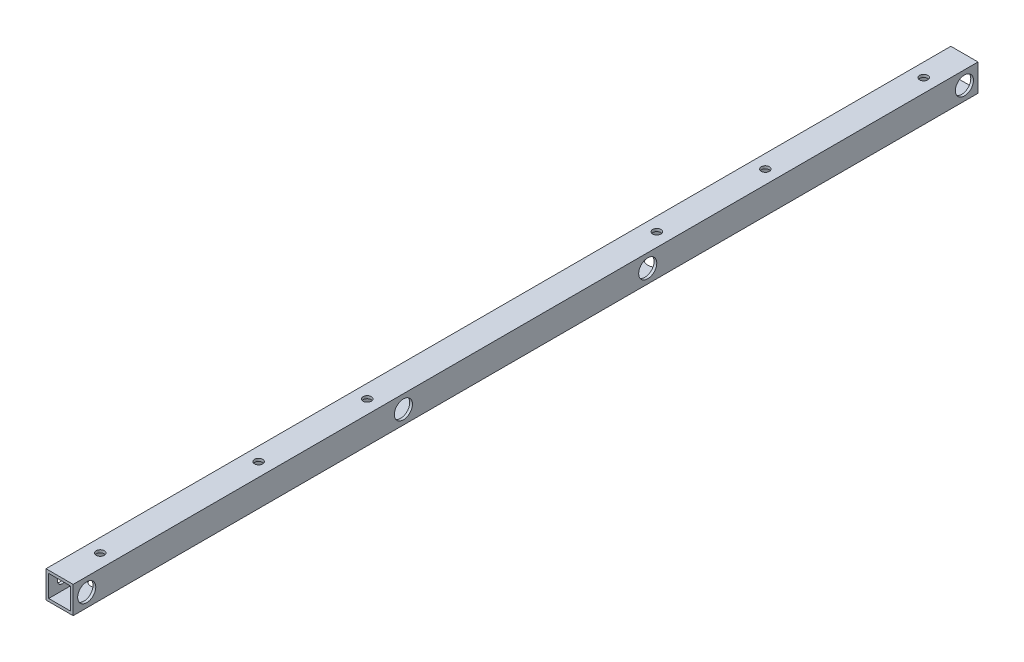
ISO-10303-21;
HEADER;
FILE_DESCRIPTION(('STEP AP214'),'2;1');
FILE_NAME('part.step','',(''),(''),'','','');
FILE_SCHEMA(('AUTOMOTIVE_DESIGN { 1 0 10303 214 1 1 1 1 }'));
ENDSEC;
DATA;
#1=APPLICATION_CONTEXT('core data for automotive mechanical design processes');
#2=APPLICATION_PROTOCOL_DEFINITION('international standard','automotive_design',2000,#1);
#3=PRODUCT_CONTEXT('',#1,'mechanical');
#4=PRODUCT('Part','Part','',(#3));
#5=PRODUCT_RELATED_PRODUCT_CATEGORY('part','',(#4));
#6=PRODUCT_DEFINITION_FORMATION('','',#4);
#7=PRODUCT_DEFINITION_CONTEXT('part definition',#1,'design');
#8=PRODUCT_DEFINITION('design','',#6,#7);
#9=PRODUCT_DEFINITION_SHAPE('','',#8);
#10=(LENGTH_UNIT() NAMED_UNIT(*) SI_UNIT(.MILLI.,.METRE.));
#11=(NAMED_UNIT(*) PLANE_ANGLE_UNIT() SI_UNIT($,.RADIAN.));
#12=(NAMED_UNIT(*) SI_UNIT($,.STERADIAN.) SOLID_ANGLE_UNIT());
#13=UNCERTAINTY_MEASURE_WITH_UNIT(LENGTH_MEASURE(1.E-05),#10,'distance_accuracy_value','');
#14=(GEOMETRIC_REPRESENTATION_CONTEXT(3) GLOBAL_UNCERTAINTY_ASSIGNED_CONTEXT((#13)) GLOBAL_UNIT_ASSIGNED_CONTEXT((#10,
#11,#12)) REPRESENTATION_CONTEXT('',''));
#15=CARTESIAN_POINT('',(0.,0.,0.));
#16=DIRECTION('',(0.,0.,1.));
#17=DIRECTION('',(1.,0.,0.));
#18=AXIS2_PLACEMENT_3D('',#15,#16,#17);
#19=CARTESIAN_POINT('',(0.,0.,500.));
#20=DIRECTION('',(0.,0.,-1.));
#21=DIRECTION('',(-1.,0.,0.));
#22=AXIS2_PLACEMENT_3D('',#19,#20,#21);
#23=PLANE('',#22);
#24=DIRECTION('',(0.,1.,0.));
#25=VECTOR('',#24,1.);
#26=CARTESIAN_POINT('',(7.5,-7.5,500.));
#27=LINE('',#26,#25);
#28=CARTESIAN_POINT('',(7.5,-7.5,500.));
#29=VERTEX_POINT('',#28);
#30=CARTESIAN_POINT('',(7.5,7.5,500.));
#31=VERTEX_POINT('',#30);
#32=EDGE_CURVE('E159',#29,#31,#27,.T.);
#33=ORIENTED_EDGE('',*,*,#32,.T.);
#34=DIRECTION('',(-1.,0.,0.));
#35=VECTOR('',#34,1.);
#36=CARTESIAN_POINT('',(-7.5,7.5,500.));
#37=LINE('',#36,#35);
#38=CARTESIAN_POINT('',(-7.5,7.5,500.));
#39=VERTEX_POINT('',#38);
#40=EDGE_CURVE('E163',#31,#39,#37,.T.);
#41=ORIENTED_EDGE('',*,*,#40,.T.);
#42=DIRECTION('',(0.,-1.,0.));
#43=VECTOR('',#42,1.);
#44=CARTESIAN_POINT('',(-7.5,-7.5,500.));
#45=LINE('',#44,#43);
#46=CARTESIAN_POINT('',(-7.5,-7.5,500.));
#47=VERTEX_POINT('',#46);
#48=EDGE_CURVE('E167',#39,#47,#45,.T.);
#49=ORIENTED_EDGE('',*,*,#48,.T.);
#50=DIRECTION('',(1.,0.,0.));
#51=VECTOR('',#50,1.);
#52=CARTESIAN_POINT('',(-7.5,-7.5,500.));
#53=LINE('',#52,#51);
#54=EDGE_CURVE('E170',#47,#29,#53,.T.);
#55=ORIENTED_EDGE('',*,*,#54,.T.);
#56=EDGE_LOOP('',(#33,#41,#49,#55));
#57=FACE_BOUND('',#56,.T.);
#58=DIRECTION('',(0.,1.,0.));
#59=VECTOR('',#58,1.);
#60=CARTESIAN_POINT('',(6.,-6.,500.));
#61=LINE('',#60,#59);
#62=CARTESIAN_POINT('',(6.,-6.,500.));
#63=VERTEX_POINT('',#62);
#64=CARTESIAN_POINT('',(6.,6.,500.));
#65=VERTEX_POINT('',#64);
#66=EDGE_CURVE('E108',#63,#65,#61,.T.);
#67=ORIENTED_EDGE('',*,*,#66,.F.);
#68=DIRECTION('',(1.,0.,0.));
#69=VECTOR('',#68,1.);
#70=CARTESIAN_POINT('',(-6.,-6.,500.));
#71=LINE('',#70,#69);
#72=CARTESIAN_POINT('',(-6.,-6.,500.));
#73=VERTEX_POINT('',#72);
#74=EDGE_CURVE('E135',#73,#63,#71,.T.);
#75=ORIENTED_EDGE('',*,*,#74,.F.);
#76=DIRECTION('',(0.,-1.,0.));
#77=VECTOR('',#76,1.);
#78=CARTESIAN_POINT('',(-6.,-6.,500.));
#79=LINE('',#78,#77);
#80=CARTESIAN_POINT('',(-6.,6.,500.));
#81=VERTEX_POINT('',#80);
#82=EDGE_CURVE('E130',#81,#73,#79,.T.);
#83=ORIENTED_EDGE('',*,*,#82,.F.);
#84=DIRECTION('',(-1.,0.,0.));
#85=VECTOR('',#84,1.);
#86=CARTESIAN_POINT('',(-6.,6.,500.));
#87=LINE('',#86,#85);
#88=EDGE_CURVE('E117',#65,#81,#87,.T.);
#89=ORIENTED_EDGE('',*,*,#88,.F.);
#90=EDGE_LOOP('',(#67,#75,#83,#89));
#91=FACE_BOUND('',#90,.T.);
#92=ADVANCED_FACE('F40',(#57,#91),#23,.F.);
#93=CARTESIAN_POINT('',(0.,0.,0.));
#94=DIRECTION('',(0.,0.,-1.));
#95=DIRECTION('',(-1.,0.,0.));
#96=AXIS2_PLACEMENT_3D('',#93,#94,#95);
#97=PLANE('',#96);
#98=DIRECTION('',(0.,1.,0.));
#99=VECTOR('',#98,1.);
#100=CARTESIAN_POINT('',(7.5,-7.5,0.));
#101=LINE('',#100,#99);
#102=CARTESIAN_POINT('',(7.5,-7.5,0.));
#103=VERTEX_POINT('',#102);
#104=CARTESIAN_POINT('',(7.5,7.5,0.));
#105=VERTEX_POINT('',#104);
#106=EDGE_CURVE('E126',#103,#105,#101,.T.);
#107=ORIENTED_EDGE('',*,*,#106,.F.);
#108=DIRECTION('',(1.,0.,0.));
#109=VECTOR('',#108,1.);
#110=CARTESIAN_POINT('',(-7.5,-7.5,0.));
#111=LINE('',#110,#109);
#112=CARTESIAN_POINT('',(-7.5,-7.5,0.));
#113=VERTEX_POINT('',#112);
#114=EDGE_CURVE('E164',#113,#103,#111,.T.);
#115=ORIENTED_EDGE('',*,*,#114,.F.);
#116=DIRECTION('',(0.,-1.,0.));
#117=VECTOR('',#116,1.);
#118=CARTESIAN_POINT('',(-7.5,-7.5,0.));
#119=LINE('',#118,#117);
#120=CARTESIAN_POINT('',(-7.5,7.5,0.));
#121=VERTEX_POINT('',#120);
#122=EDGE_CURVE('E180',#121,#113,#119,.T.);
#123=ORIENTED_EDGE('',*,*,#122,.F.);
#124=DIRECTION('',(-1.,0.,0.));
#125=VECTOR('',#124,1.);
#126=CARTESIAN_POINT('',(-7.5,7.5,0.));
#127=LINE('',#126,#125);
#128=EDGE_CURVE('E177',#105,#121,#127,.T.);
#129=ORIENTED_EDGE('',*,*,#128,.F.);
#130=EDGE_LOOP('',(#107,#115,#123,#129));
#131=FACE_BOUND('',#130,.T.);
#132=DIRECTION('',(1.,0.,0.));
#133=VECTOR('',#132,1.);
#134=CARTESIAN_POINT('',(-6.,-6.,0.));
#135=LINE('',#134,#133);
#136=CARTESIAN_POINT('',(-6.,-6.,0.));
#137=VERTEX_POINT('',#136);
#138=CARTESIAN_POINT('',(6.,-6.,0.));
#139=VERTEX_POINT('',#138);
#140=EDGE_CURVE('E118',#137,#139,#135,.T.);
#141=ORIENTED_EDGE('',*,*,#140,.T.);
#142=DIRECTION('',(0.,1.,0.));
#143=VECTOR('',#142,1.);
#144=CARTESIAN_POINT('',(6.,-6.,0.));
#145=LINE('',#144,#143);
#146=CARTESIAN_POINT('',(6.,6.,0.));
#147=VERTEX_POINT('',#146);
#148=EDGE_CURVE('E66',#139,#147,#145,.T.);
#149=ORIENTED_EDGE('',*,*,#148,.T.);
#150=DIRECTION('',(-1.,0.,0.));
#151=VECTOR('',#150,1.);
#152=CARTESIAN_POINT('',(-6.,6.,0.));
#153=LINE('',#152,#151);
#154=CARTESIAN_POINT('',(-6.,6.,0.));
#155=VERTEX_POINT('',#154);
#156=EDGE_CURVE('E124',#147,#155,#153,.T.);
#157=ORIENTED_EDGE('',*,*,#156,.T.);
#158=DIRECTION('',(0.,-1.,0.));
#159=VECTOR('',#158,1.);
#160=CARTESIAN_POINT('',(-6.,-6.,0.));
#161=LINE('',#160,#159);
#162=EDGE_CURVE('E146',#155,#137,#161,.T.);
#163=ORIENTED_EDGE('',*,*,#162,.T.);
#164=EDGE_LOOP('',(#141,#149,#157,#163));
#165=FACE_BOUND('',#164,.T.);
#166=ADVANCED_FACE('F365',(#131,#165),#97,.T.);
#167=CARTESIAN_POINT('',(7.5,-7.5,500.));
#168=DIRECTION('',(-1.,0.,0.));
#169=DIRECTION('',(0.,0.,1.));
#170=AXIS2_PLACEMENT_3D('',#167,#168,#169);
#171=PLANE('',#170);
#172=CARTESIAN_POINT('',(7.5,0.,492.5));
#173=DIRECTION('',(1.,0.,0.));
#174=DIRECTION('',(0.,0.,-1.));
#175=AXIS2_PLACEMENT_3D('',#172,#173,#174);
#176=CIRCLE('',#175,4.99999999999999);
#177=CARTESIAN_POINT('',(7.5,0.,487.5));
#178=VERTEX_POINT('',#177);
#179=EDGE_CURVE('E246',#178,#178,#176,.T.);
#180=ORIENTED_EDGE('',*,*,#179,.F.);
#181=EDGE_LOOP('',(#180));
#182=FACE_BOUND('',#181,.T.);
#183=CARTESIAN_POINT('',(7.5,0.,317.5));
#184=DIRECTION('',(1.,0.,0.));
#185=DIRECTION('',(0.,0.,-1.));
#186=AXIS2_PLACEMENT_3D('',#183,#184,#185);
#187=CIRCLE('',#186,4.99999999999999);
#188=CARTESIAN_POINT('',(7.5,0.,312.5));
#189=VERTEX_POINT('',#188);
#190=EDGE_CURVE('E515',#189,#189,#187,.T.);
#191=ORIENTED_EDGE('',*,*,#190,.F.);
#192=EDGE_LOOP('',(#191));
#193=FACE_BOUND('',#192,.T.);
#194=CARTESIAN_POINT('',(7.5,0.,182.5));
#195=DIRECTION('',(1.,0.,0.));
#196=DIRECTION('',(0.,0.,-1.));
#197=AXIS2_PLACEMENT_3D('',#194,#195,#196);
#198=CIRCLE('',#197,4.99999999999999);
#199=CARTESIAN_POINT('',(7.5,0.,177.5));
#200=VERTEX_POINT('',#199);
#201=EDGE_CURVE('E520',#200,#200,#198,.T.);
#202=ORIENTED_EDGE('',*,*,#201,.F.);
#203=EDGE_LOOP('',(#202));
#204=FACE_BOUND('',#203,.T.);
#205=CARTESIAN_POINT('',(7.5,0.,7.5));
#206=DIRECTION('',(1.,0.,0.));
#207=DIRECTION('',(0.,0.,-1.));
#208=AXIS2_PLACEMENT_3D('',#205,#206,#207);
#209=CIRCLE('',#208,5.);
#210=CARTESIAN_POINT('',(7.5,0.,2.5));
#211=VERTEX_POINT('',#210);
#212=EDGE_CURVE('E525',#211,#211,#209,.T.);
#213=ORIENTED_EDGE('',*,*,#212,.F.);
#214=EDGE_LOOP('',(#213));
#215=FACE_BOUND('',#214,.T.);
#216=ORIENTED_EDGE('',*,*,#106,.T.);
#217=DIRECTION('',(0.,0.,-1.));
#218=VECTOR('',#217,1.);
#219=CARTESIAN_POINT('',(7.5,7.5,500.));
#220=LINE('',#219,#218);
#221=EDGE_CURVE('E11',#31,#105,#220,.T.);
#222=ORIENTED_EDGE('',*,*,#221,.F.);
#223=ORIENTED_EDGE('',*,*,#32,.F.);
#224=DIRECTION('',(0.,0.,-1.));
#225=VECTOR('',#224,1.);
#226=CARTESIAN_POINT('',(7.5,-7.5,500.));
#227=LINE('',#226,#225);
#228=EDGE_CURVE('E173',#29,#103,#227,.T.);
#229=ORIENTED_EDGE('',*,*,#228,.T.);
#230=EDGE_LOOP('',(#216,#222,#223,#229));
#231=FACE_BOUND('',#230,.T.);
#232=ADVANCED_FACE('F42',(#182,#193,#204,#215,#231),#171,.F.);
#233=CARTESIAN_POINT('',(-7.5,7.5,500.));
#234=DIRECTION('',(0.,-1.,0.));
#235=DIRECTION('',(0.,0.,-1.));
#236=AXIS2_PLACEMENT_3D('',#233,#234,#235);
#237=PLANE('',#236);
#238=CARTESIAN_POINT('',(0.,7.5,390.));
#239=DIRECTION('',(0.,-1.,0.));
#240=DIRECTION('',(0.,0.,-1.));
#241=AXIS2_PLACEMENT_3D('',#238,#239,#240);
#242=CIRCLE('',#241,2.25);
#243=CARTESIAN_POINT('',(0.,7.5,387.75));
#244=VERTEX_POINT('',#243);
#245=EDGE_CURVE('E313',#244,#244,#242,.T.);
#246=ORIENTED_EDGE('',*,*,#245,.T.);
#247=EDGE_LOOP('',(#246));
#248=FACE_BOUND('',#247,.T.);
#249=CARTESIAN_POINT('',(2.05814939933146E-13,7.5,330.));
#250=DIRECTION('',(0.,-1.,0.));
#251=DIRECTION('',(0.,0.,-1.));
#252=AXIS2_PLACEMENT_3D('',#249,#250,#251);
#253=CIRCLE('',#252,2.25);
#254=CARTESIAN_POINT('',(2.05814939933146E-13,7.5,327.75));
#255=VERTEX_POINT('',#254);
#256=EDGE_CURVE('E305',#255,#255,#253,.T.);
#257=ORIENTED_EDGE('',*,*,#256,.T.);
#258=EDGE_LOOP('',(#257));
#259=FACE_BOUND('',#258,.T.);
#260=CARTESIAN_POINT('',(7.54654779754869E-13,7.5,170.));
#261=DIRECTION('',(0.,-1.,0.));
#262=DIRECTION('',(0.,0.,-1.));
#263=AXIS2_PLACEMENT_3D('',#260,#261,#262);
#264=CIRCLE('',#263,2.25);
#265=CARTESIAN_POINT('',(7.54654779754869E-13,7.5,167.75));
#266=VERTEX_POINT('',#265);
#267=EDGE_CURVE('E297',#266,#266,#264,.T.);
#268=ORIENTED_EDGE('',*,*,#267,.T.);
#269=EDGE_LOOP('',(#268));
#270=FACE_BOUND('',#269,.T.);
#271=CARTESIAN_POINT('',(9.61961098007528E-13,7.5,110.));
#272=DIRECTION('',(0.,-1.,0.));
#273=DIRECTION('',(0.,0.,-1.));
#274=AXIS2_PLACEMENT_3D('',#271,#272,#273);
#275=CIRCLE('',#274,2.25);
#276=CARTESIAN_POINT('',(9.61961098007528E-13,7.5,107.75));
#277=VERTEX_POINT('',#276);
#278=EDGE_CURVE('E289',#277,#277,#275,.T.);
#279=ORIENTED_EDGE('',*,*,#278,.T.);
#280=EDGE_LOOP('',(#279));
#281=FACE_BOUND('',#280,.T.);
#282=CARTESIAN_POINT('',(0.,7.5,22.5));
#283=DIRECTION('',(0.,1.,0.));
#284=DIRECTION('',(0.,0.,1.));
#285=AXIS2_PLACEMENT_3D('',#282,#283,#284);
#286=CIRCLE('',#285,2.25);
#287=CARTESIAN_POINT('',(0.,7.5,24.75));
#288=VERTEX_POINT('',#287);
#289=EDGE_CURVE('E318',#288,#288,#286,.T.);
#290=ORIENTED_EDGE('',*,*,#289,.F.);
#291=EDGE_LOOP('',(#290));
#292=FACE_BOUND('',#291,.T.);
#293=CARTESIAN_POINT('',(0.,7.5,477.5));
#294=DIRECTION('',(0.,1.,0.));
#295=DIRECTION('',(0.,0.,1.));
#296=AXIS2_PLACEMENT_3D('',#293,#294,#295);
#297=CIRCLE('',#296,2.25);
#298=CARTESIAN_POINT('',(0.,7.5,479.75));
#299=VERTEX_POINT('',#298);
#300=EDGE_CURVE('E317',#299,#299,#297,.T.);
#301=ORIENTED_EDGE('',*,*,#300,.F.);
#302=EDGE_LOOP('',(#301));
#303=FACE_BOUND('',#302,.T.);
#304=ORIENTED_EDGE('',*,*,#128,.T.);
#305=DIRECTION('',(0.,0.,-1.));
#306=VECTOR('',#305,1.);
#307=CARTESIAN_POINT('',(-7.5,7.5,500.));
#308=LINE('',#307,#306);
#309=EDGE_CURVE('E50',#39,#121,#308,.T.);
#310=ORIENTED_EDGE('',*,*,#309,.F.);
#311=ORIENTED_EDGE('',*,*,#40,.F.);
#312=ORIENTED_EDGE('',*,*,#221,.T.);
#313=EDGE_LOOP('',(#304,#310,#311,#312));
#314=FACE_BOUND('',#313,.T.);
#315=ADVANCED_FACE('F381',(#248,#259,#270,#281,#292,#303,#314),#237,.F.);
#316=CARTESIAN_POINT('',(-7.5,-7.5,500.));
#317=DIRECTION('',(1.,0.,0.));
#318=DIRECTION('',(0.,0.,-1.));
#319=AXIS2_PLACEMENT_3D('',#316,#317,#318);
#320=PLANE('',#319);
#321=CARTESIAN_POINT('',(-7.5,0.,492.5));
#322=DIRECTION('',(1.,0.,0.));
#323=DIRECTION('',(0.,0.,-1.));
#324=AXIS2_PLACEMENT_3D('',#321,#322,#323);
#325=CIRCLE('',#324,2.69999999999996);
#326=CARTESIAN_POINT('',(-7.5,0.,489.8));
#327=VERTEX_POINT('',#326);
#328=EDGE_CURVE('E143',#327,#327,#325,.T.);
#329=ORIENTED_EDGE('',*,*,#328,.T.);
#330=EDGE_LOOP('',(#329));
#331=FACE_BOUND('',#330,.T.);
#332=CARTESIAN_POINT('',(-7.5,0.,317.5));
#333=DIRECTION('',(1.,0.,0.));
#334=DIRECTION('',(0.,0.,-1.));
#335=AXIS2_PLACEMENT_3D('',#332,#333,#334);
#336=CIRCLE('',#335,2.69999999999996);
#337=CARTESIAN_POINT('',(-7.5,0.,314.8));
#338=VERTEX_POINT('',#337);
#339=EDGE_CURVE('E210',#338,#338,#336,.T.);
#340=ORIENTED_EDGE('',*,*,#339,.T.);
#341=EDGE_LOOP('',(#340));
#342=FACE_BOUND('',#341,.T.);
#343=CARTESIAN_POINT('',(-7.5,0.,182.5));
#344=DIRECTION('',(1.,0.,0.));
#345=DIRECTION('',(0.,0.,-1.));
#346=AXIS2_PLACEMENT_3D('',#343,#344,#345);
#347=CIRCLE('',#346,2.70000000000001);
#348=CARTESIAN_POINT('',(-7.5,0.,179.8));
#349=VERTEX_POINT('',#348);
#350=EDGE_CURVE('E205',#349,#349,#347,.T.);
#351=ORIENTED_EDGE('',*,*,#350,.T.);
#352=EDGE_LOOP('',(#351));
#353=FACE_BOUND('',#352,.T.);
#354=CARTESIAN_POINT('',(-7.5,0.,7.5));
#355=DIRECTION('',(1.,0.,0.));
#356=DIRECTION('',(0.,0.,-1.));
#357=AXIS2_PLACEMENT_3D('',#354,#355,#356);
#358=CIRCLE('',#357,2.7);
#359=CARTESIAN_POINT('',(-7.5,0.,4.8));
#360=VERTEX_POINT('',#359);
#361=EDGE_CURVE('E199',#360,#360,#358,.T.);
#362=ORIENTED_EDGE('',*,*,#361,.T.);
#363=EDGE_LOOP('',(#362));
#364=FACE_BOUND('',#363,.T.);
#365=ORIENTED_EDGE('',*,*,#122,.T.);
#366=DIRECTION('',(0.,0.,-1.));
#367=VECTOR('',#366,1.);
#368=CARTESIAN_POINT('',(-7.5,-7.5,500.));
#369=LINE('',#368,#367);
#370=EDGE_CURVE('E188',#47,#113,#369,.T.);
#371=ORIENTED_EDGE('',*,*,#370,.F.);
#372=ORIENTED_EDGE('',*,*,#48,.F.);
#373=ORIENTED_EDGE('',*,*,#309,.T.);
#374=EDGE_LOOP('',(#365,#371,#372,#373));
#375=FACE_BOUND('',#374,.T.);
#376=ADVANCED_FACE('F345',(#331,#342,#353,#364,#375),#320,.F.);
#377=CARTESIAN_POINT('',(-7.5,-7.5,500.));
#378=DIRECTION('',(0.,1.,0.));
#379=DIRECTION('',(0.,0.,1.));
#380=AXIS2_PLACEMENT_3D('',#377,#378,#379);
#381=PLANE('',#380);
#382=CARTESIAN_POINT('',(0.,-7.5,22.5));
#383=DIRECTION('',(0.,1.,0.));
#384=DIRECTION('',(0.,0.,1.));
#385=AXIS2_PLACEMENT_3D('',#382,#383,#384);
#386=CIRCLE('',#385,5.);
#387=CARTESIAN_POINT('',(0.,-7.5,27.5));
#388=VERTEX_POINT('',#387);
#389=EDGE_CURVE('E220',#388,#388,#386,.T.);
#390=ORIENTED_EDGE('',*,*,#389,.T.);
#391=EDGE_LOOP('',(#390));
#392=FACE_BOUND('',#391,.T.);
#393=CARTESIAN_POINT('',(7.54654779754869E-13,-7.5,170.));
#394=DIRECTION('',(0.,1.,0.));
#395=DIRECTION('',(0.,0.,1.));
#396=AXIS2_PLACEMENT_3D('',#393,#394,#395);
#397=CIRCLE('',#396,5.);
#398=CARTESIAN_POINT('',(7.54654779754869E-13,-7.5,175.));
#399=VERTEX_POINT('',#398);
#400=EDGE_CURVE('E257',#399,#399,#397,.T.);
#401=ORIENTED_EDGE('',*,*,#400,.T.);
#402=EDGE_LOOP('',(#401));
#403=FACE_BOUND('',#402,.T.);
#404=CARTESIAN_POINT('',(9.61961098007528E-13,-7.5,110.));
#405=DIRECTION('',(0.,1.,0.));
#406=DIRECTION('',(0.,0.,1.));
#407=AXIS2_PLACEMENT_3D('',#404,#405,#406);
#408=CIRCLE('',#407,5.);
#409=CARTESIAN_POINT('',(9.61961098007528E-13,-7.5,115.));
#410=VERTEX_POINT('',#409);
#411=EDGE_CURVE('E263',#410,#410,#408,.T.);
#412=ORIENTED_EDGE('',*,*,#411,.T.);
#413=EDGE_LOOP('',(#412));
#414=FACE_BOUND('',#413,.T.);
#415=CARTESIAN_POINT('',(2.05814939933146E-13,-7.5,330.));
#416=DIRECTION('',(0.,1.,0.));
#417=DIRECTION('',(0.,0.,1.));
#418=AXIS2_PLACEMENT_3D('',#415,#416,#417);
#419=CIRCLE('',#418,5.);
#420=CARTESIAN_POINT('',(2.05814939933146E-13,-7.5,335.));
#421=VERTEX_POINT('',#420);
#422=EDGE_CURVE('E270',#421,#421,#419,.T.);
#423=ORIENTED_EDGE('',*,*,#422,.T.);
#424=EDGE_LOOP('',(#423));
#425=FACE_BOUND('',#424,.T.);
#426=CARTESIAN_POINT('',(0.,-7.5,390.));
#427=DIRECTION('',(0.,1.,0.));
#428=DIRECTION('',(0.,0.,1.));
#429=AXIS2_PLACEMENT_3D('',#426,#427,#428);
#430=CIRCLE('',#429,5.);
#431=CARTESIAN_POINT('',(0.,-7.5,395.));
#432=VERTEX_POINT('',#431);
#433=EDGE_CURVE('E279',#432,#432,#430,.T.);
#434=ORIENTED_EDGE('',*,*,#433,.T.);
#435=EDGE_LOOP('',(#434));
#436=FACE_BOUND('',#435,.T.);
#437=CARTESIAN_POINT('',(0.,-7.5,477.5));
#438=DIRECTION('',(0.,1.,0.));
#439=DIRECTION('',(0.,0.,1.));
#440=AXIS2_PLACEMENT_3D('',#437,#438,#439);
#441=CIRCLE('',#440,5.);
#442=CARTESIAN_POINT('',(0.,-7.5,482.5));
#443=VERTEX_POINT('',#442);
#444=EDGE_CURVE('E275',#443,#443,#441,.T.);
#445=ORIENTED_EDGE('',*,*,#444,.T.);
#446=EDGE_LOOP('',(#445));
#447=FACE_BOUND('',#446,.T.);
#448=ORIENTED_EDGE('',*,*,#114,.T.);
#449=ORIENTED_EDGE('',*,*,#228,.F.);
#450=ORIENTED_EDGE('',*,*,#54,.F.);
#451=ORIENTED_EDGE('',*,*,#370,.T.);
#452=EDGE_LOOP('',(#448,#449,#450,#451));
#453=FACE_BOUND('',#452,.T.);
#454=ADVANCED_FACE('F376',(#392,#403,#414,#425,#436,#447,#453),#381,.F.);
#455=CARTESIAN_POINT('',(6.,-6.,500.));
#456=DIRECTION('',(-1.,0.,0.));
#457=DIRECTION('',(0.,0.,1.));
#458=AXIS2_PLACEMENT_3D('',#455,#456,#457);
#459=PLANE('',#458);
#460=CARTESIAN_POINT('',(6.,0.,492.5));
#461=DIRECTION('',(-1.,0.,0.));
#462=DIRECTION('',(0.,0.,1.));
#463=AXIS2_PLACEMENT_3D('',#460,#461,#462);
#464=CIRCLE('',#463,4.99999999999999);
#465=CARTESIAN_POINT('',(6.,0.,497.5));
#466=VERTEX_POINT('',#465);
#467=EDGE_CURVE('E44',#466,#466,#464,.T.);
#468=ORIENTED_EDGE('',*,*,#467,.F.);
#469=EDGE_LOOP('',(#468));
#470=FACE_BOUND('',#469,.T.);
#471=CARTESIAN_POINT('',(6.,0.,317.5));
#472=DIRECTION('',(-1.,0.,0.));
#473=DIRECTION('',(0.,0.,1.));
#474=AXIS2_PLACEMENT_3D('',#471,#472,#473);
#475=CIRCLE('',#474,4.99999999999999);
#476=CARTESIAN_POINT('',(6.,0.,322.5));
#477=VERTEX_POINT('',#476);
#478=EDGE_CURVE('E249',#477,#477,#475,.T.);
#479=ORIENTED_EDGE('',*,*,#478,.F.);
#480=EDGE_LOOP('',(#479));
#481=FACE_BOUND('',#480,.T.);
#482=CARTESIAN_POINT('',(6.,0.,182.5));
#483=DIRECTION('',(-1.,0.,0.));
#484=DIRECTION('',(0.,0.,1.));
#485=AXIS2_PLACEMENT_3D('',#482,#483,#484);
#486=CIRCLE('',#485,4.99999999999999);
#487=CARTESIAN_POINT('',(6.,0.,187.5));
#488=VERTEX_POINT('',#487);
#489=EDGE_CURVE('E245',#488,#488,#486,.T.);
#490=ORIENTED_EDGE('',*,*,#489,.F.);
#491=EDGE_LOOP('',(#490));
#492=FACE_BOUND('',#491,.T.);
#493=CARTESIAN_POINT('',(6.,0.,7.5));
#494=DIRECTION('',(-1.,0.,0.));
#495=DIRECTION('',(0.,0.,1.));
#496=AXIS2_PLACEMENT_3D('',#493,#494,#495);
#497=CIRCLE('',#496,5.);
#498=CARTESIAN_POINT('',(6.,0.,12.5));
#499=VERTEX_POINT('',#498);
#500=EDGE_CURVE('E241',#499,#499,#497,.T.);
#501=ORIENTED_EDGE('',*,*,#500,.F.);
#502=EDGE_LOOP('',(#501));
#503=FACE_BOUND('',#502,.T.);
#504=ORIENTED_EDGE('',*,*,#148,.F.);
#505=DIRECTION('',(0.,0.,-1.));
#506=VECTOR('',#505,1.);
#507=CARTESIAN_POINT('',(6.,-6.,500.));
#508=LINE('',#507,#506);
#509=EDGE_CURVE('E112',#63,#139,#508,.T.);
#510=ORIENTED_EDGE('',*,*,#509,.F.);
#511=ORIENTED_EDGE('',*,*,#66,.T.);
#512=DIRECTION('',(0.,0.,-1.));
#513=VECTOR('',#512,1.);
#514=CARTESIAN_POINT('',(6.,6.,500.));
#515=LINE('',#514,#513);
#516=EDGE_CURVE('E111',#65,#147,#515,.T.);
#517=ORIENTED_EDGE('',*,*,#516,.T.);
#518=EDGE_LOOP('',(#504,#510,#511,#517));
#519=FACE_BOUND('',#518,.T.);
#520=ADVANCED_FACE('F110',(#470,#481,#492,#503,#519),#459,.T.);
#521=CARTESIAN_POINT('',(-6.,6.,500.));
#522=DIRECTION('',(0.,-1.,0.));
#523=DIRECTION('',(0.,0.,-1.));
#524=AXIS2_PLACEMENT_3D('',#521,#522,#523);
#525=PLANE('',#524);
#526=CARTESIAN_POINT('',(0.,6.,390.));
#527=DIRECTION('',(0.,-1.,0.));
#528=DIRECTION('',(0.,0.,-1.));
#529=AXIS2_PLACEMENT_3D('',#526,#527,#528);
#530=CIRCLE('',#529,2.25);
#531=CARTESIAN_POINT('',(0.,6.,387.75));
#532=VERTEX_POINT('',#531);
#533=EDGE_CURVE('E309',#532,#532,#530,.T.);
#534=ORIENTED_EDGE('',*,*,#533,.F.);
#535=EDGE_LOOP('',(#534));
#536=FACE_BOUND('',#535,.T.);
#537=CARTESIAN_POINT('',(2.05814939933146E-13,6.,330.));
#538=DIRECTION('',(0.,-1.,0.));
#539=DIRECTION('',(0.,0.,-1.));
#540=AXIS2_PLACEMENT_3D('',#537,#538,#539);
#541=CIRCLE('',#540,2.25);
#542=CARTESIAN_POINT('',(2.05814939933146E-13,6.,327.75));
#543=VERTEX_POINT('',#542);
#544=EDGE_CURVE('E301',#543,#543,#541,.T.);
#545=ORIENTED_EDGE('',*,*,#544,.F.);
#546=EDGE_LOOP('',(#545));
#547=FACE_BOUND('',#546,.T.);
#548=CARTESIAN_POINT('',(7.54654779754869E-13,6.,170.));
#549=DIRECTION('',(0.,-1.,0.));
#550=DIRECTION('',(0.,0.,-1.));
#551=AXIS2_PLACEMENT_3D('',#548,#549,#550);
#552=CIRCLE('',#551,2.25);
#553=CARTESIAN_POINT('',(7.54654779754869E-13,6.,167.75));
#554=VERTEX_POINT('',#553);
#555=EDGE_CURVE('E293',#554,#554,#552,.T.);
#556=ORIENTED_EDGE('',*,*,#555,.F.);
#557=EDGE_LOOP('',(#556));
#558=FACE_BOUND('',#557,.T.);
#559=CARTESIAN_POINT('',(9.61961098007528E-13,6.,110.));
#560=DIRECTION('',(0.,-1.,0.));
#561=DIRECTION('',(0.,0.,-1.));
#562=AXIS2_PLACEMENT_3D('',#559,#560,#561);
#563=CIRCLE('',#562,2.25);
#564=CARTESIAN_POINT('',(9.61961098007528E-13,6.,107.75));
#565=VERTEX_POINT('',#564);
#566=EDGE_CURVE('E240',#565,#565,#563,.T.);
#567=ORIENTED_EDGE('',*,*,#566,.F.);
#568=EDGE_LOOP('',(#567));
#569=FACE_BOUND('',#568,.T.);
#570=CARTESIAN_POINT('',(0.,6.,22.5));
#571=DIRECTION('',(0.,-1.,0.));
#572=DIRECTION('',(0.,0.,-1.));
#573=AXIS2_PLACEMENT_3D('',#570,#571,#572);
#574=CIRCLE('',#573,2.25);
#575=CARTESIAN_POINT('',(0.,6.,20.25));
#576=VERTEX_POINT('',#575);
#577=EDGE_CURVE('E200',#576,#576,#574,.T.);
#578=ORIENTED_EDGE('',*,*,#577,.F.);
#579=EDGE_LOOP('',(#578));
#580=FACE_BOUND('',#579,.T.);
#581=CARTESIAN_POINT('',(0.,6.,477.5));
#582=DIRECTION('',(0.,-1.,0.));
#583=DIRECTION('',(0.,0.,-1.));
#584=AXIS2_PLACEMENT_3D('',#581,#582,#583);
#585=CIRCLE('',#584,2.25);
#586=CARTESIAN_POINT('',(0.,6.,475.25));
#587=VERTEX_POINT('',#586);
#588=EDGE_CURVE('E322',#587,#587,#585,.T.);
#589=ORIENTED_EDGE('',*,*,#588,.F.);
#590=EDGE_LOOP('',(#589));
#591=FACE_BOUND('',#590,.T.);
#592=ORIENTED_EDGE('',*,*,#156,.F.);
#593=ORIENTED_EDGE('',*,*,#516,.F.);
#594=ORIENTED_EDGE('',*,*,#88,.T.);
#595=DIRECTION('',(0.,0.,-1.));
#596=VECTOR('',#595,1.);
#597=CARTESIAN_POINT('',(-6.,6.,500.));
#598=LINE('',#597,#596);
#599=EDGE_CURVE('E127',#81,#155,#598,.T.);
#600=ORIENTED_EDGE('',*,*,#599,.T.);
#601=EDGE_LOOP('',(#592,#593,#594,#600));
#602=FACE_BOUND('',#601,.T.);
#603=ADVANCED_FACE('F121',(#536,#547,#558,#569,#580,#591,#602),#525,.T.);
#604=CARTESIAN_POINT('',(-6.,-6.,500.));
#605=DIRECTION('',(1.,0.,0.));
#606=DIRECTION('',(0.,0.,-1.));
#607=AXIS2_PLACEMENT_3D('',#604,#605,#606);
#608=PLANE('',#607);
#609=CARTESIAN_POINT('',(-6.,0.,492.5));
#610=DIRECTION('',(1.,0.,0.));
#611=DIRECTION('',(0.,0.,-1.));
#612=AXIS2_PLACEMENT_3D('',#609,#610,#611);
#613=CIRCLE('',#612,2.69999999999996);
#614=CARTESIAN_POINT('',(-6.,0.,489.8));
#615=VERTEX_POINT('',#614);
#616=EDGE_CURVE('E211',#615,#615,#613,.T.);
#617=ORIENTED_EDGE('',*,*,#616,.F.);
#618=EDGE_LOOP('',(#617));
#619=FACE_BOUND('',#618,.T.);
#620=CARTESIAN_POINT('',(-6.,0.,317.5));
#621=DIRECTION('',(1.,0.,0.));
#622=DIRECTION('',(0.,0.,-1.));
#623=AXIS2_PLACEMENT_3D('',#620,#621,#622);
#624=CIRCLE('',#623,2.69999999999996);
#625=CARTESIAN_POINT('',(-6.,0.,314.8));
#626=VERTEX_POINT('',#625);
#627=EDGE_CURVE('E206',#626,#626,#624,.T.);
#628=ORIENTED_EDGE('',*,*,#627,.F.);
#629=EDGE_LOOP('',(#628));
#630=FACE_BOUND('',#629,.T.);
#631=CARTESIAN_POINT('',(-6.,0.,182.5));
#632=DIRECTION('',(1.,0.,0.));
#633=DIRECTION('',(0.,0.,-1.));
#634=AXIS2_PLACEMENT_3D('',#631,#632,#633);
#635=CIRCLE('',#634,2.70000000000001);
#636=CARTESIAN_POINT('',(-6.,0.,179.8));
#637=VERTEX_POINT('',#636);
#638=EDGE_CURVE('E201',#637,#637,#635,.T.);
#639=ORIENTED_EDGE('',*,*,#638,.F.);
#640=EDGE_LOOP('',(#639));
#641=FACE_BOUND('',#640,.T.);
#642=CARTESIAN_POINT('',(-6.,0.,7.5));
#643=DIRECTION('',(1.,0.,0.));
#644=DIRECTION('',(0.,0.,-1.));
#645=AXIS2_PLACEMENT_3D('',#642,#643,#644);
#646=CIRCLE('',#645,2.7);
#647=CARTESIAN_POINT('',(-6.,0.,4.8));
#648=VERTEX_POINT('',#647);
#649=EDGE_CURVE('E195',#648,#648,#646,.T.);
#650=ORIENTED_EDGE('',*,*,#649,.F.);
#651=EDGE_LOOP('',(#650));
#652=FACE_BOUND('',#651,.T.);
#653=ORIENTED_EDGE('',*,*,#162,.F.);
#654=ORIENTED_EDGE('',*,*,#599,.F.);
#655=ORIENTED_EDGE('',*,*,#82,.T.);
#656=DIRECTION('',(0.,0.,-1.));
#657=VECTOR('',#656,1.);
#658=CARTESIAN_POINT('',(-6.,-6.,500.));
#659=LINE('',#658,#657);
#660=EDGE_CURVE('E58',#73,#137,#659,.T.);
#661=ORIENTED_EDGE('',*,*,#660,.T.);
#662=EDGE_LOOP('',(#653,#654,#655,#661));
#663=FACE_BOUND('',#662,.T.);
#664=ADVANCED_FACE('F420',(#619,#630,#641,#652,#663),#608,.T.);
#665=CARTESIAN_POINT('',(-6.,-6.,500.));
#666=DIRECTION('',(0.,1.,0.));
#667=DIRECTION('',(0.,0.,1.));
#668=AXIS2_PLACEMENT_3D('',#665,#666,#667);
#669=PLANE('',#668);
#670=CARTESIAN_POINT('',(0.,-6.,22.5));
#671=DIRECTION('',(0.,1.,0.));
#672=DIRECTION('',(0.,0.,1.));
#673=AXIS2_PLACEMENT_3D('',#670,#671,#672);
#674=CIRCLE('',#673,5.);
#675=CARTESIAN_POINT('',(0.,-6.,27.5));
#676=VERTEX_POINT('',#675);
#677=EDGE_CURVE('E236',#676,#676,#674,.F.);
#678=ORIENTED_EDGE('',*,*,#677,.T.);
#679=EDGE_LOOP('',(#678));
#680=FACE_BOUND('',#679,.T.);
#681=CARTESIAN_POINT('',(7.54654779754869E-13,-6.,170.));
#682=DIRECTION('',(0.,1.,0.));
#683=DIRECTION('',(0.,0.,1.));
#684=AXIS2_PLACEMENT_3D('',#681,#682,#683);
#685=CIRCLE('',#684,5.);
#686=CARTESIAN_POINT('',(7.54654779754869E-13,-6.,175.));
#687=VERTEX_POINT('',#686);
#688=EDGE_CURVE('E232',#687,#687,#685,.F.);
#689=ORIENTED_EDGE('',*,*,#688,.T.);
#690=EDGE_LOOP('',(#689));
#691=FACE_BOUND('',#690,.T.);
#692=CARTESIAN_POINT('',(9.61961098007528E-13,-6.,110.));
#693=DIRECTION('',(0.,1.,0.));
#694=DIRECTION('',(0.,0.,1.));
#695=AXIS2_PLACEMENT_3D('',#692,#693,#694);
#696=CIRCLE('',#695,5.);
#697=CARTESIAN_POINT('',(9.61961098007528E-13,-6.,115.));
#698=VERTEX_POINT('',#697);
#699=EDGE_CURVE('E228',#698,#698,#696,.F.);
#700=ORIENTED_EDGE('',*,*,#699,.T.);
#701=EDGE_LOOP('',(#700));
#702=FACE_BOUND('',#701,.T.);
#703=CARTESIAN_POINT('',(2.05814939933146E-13,-6.,330.));
#704=DIRECTION('',(0.,1.,0.));
#705=DIRECTION('',(0.,0.,1.));
#706=AXIS2_PLACEMENT_3D('',#703,#704,#705);
#707=CIRCLE('',#706,5.);
#708=CARTESIAN_POINT('',(2.05814939933146E-13,-6.,335.));
#709=VERTEX_POINT('',#708);
#710=EDGE_CURVE('E224',#709,#709,#707,.F.);
#711=ORIENTED_EDGE('',*,*,#710,.T.);
#712=EDGE_LOOP('',(#711));
#713=FACE_BOUND('',#712,.T.);
#714=CARTESIAN_POINT('',(0.,-6.,390.));
#715=DIRECTION('',(0.,1.,0.));
#716=DIRECTION('',(0.,0.,1.));
#717=AXIS2_PLACEMENT_3D('',#714,#715,#716);
#718=CIRCLE('',#717,5.);
#719=CARTESIAN_POINT('',(0.,-6.,395.));
#720=VERTEX_POINT('',#719);
#721=EDGE_CURVE('E219',#720,#720,#718,.F.);
#722=ORIENTED_EDGE('',*,*,#721,.T.);
#723=EDGE_LOOP('',(#722));
#724=FACE_BOUND('',#723,.T.);
#725=CARTESIAN_POINT('',(0.,-6.,477.5));
#726=DIRECTION('',(0.,1.,0.));
#727=DIRECTION('',(0.,0.,1.));
#728=AXIS2_PLACEMENT_3D('',#725,#726,#727);
#729=CIRCLE('',#728,5.);
#730=CARTESIAN_POINT('',(0.,-6.,482.5));
#731=VERTEX_POINT('',#730);
#732=EDGE_CURVE('E215',#731,#731,#729,.F.);
#733=ORIENTED_EDGE('',*,*,#732,.T.);
#734=EDGE_LOOP('',(#733));
#735=FACE_BOUND('',#734,.T.);
#736=ORIENTED_EDGE('',*,*,#140,.F.);
#737=ORIENTED_EDGE('',*,*,#660,.F.);
#738=ORIENTED_EDGE('',*,*,#74,.T.);
#739=ORIENTED_EDGE('',*,*,#509,.T.);
#740=EDGE_LOOP('',(#736,#737,#738,#739));
#741=FACE_BOUND('',#740,.T.);
#742=ADVANCED_FACE('F417',(#680,#691,#702,#713,#724,#735,#741),#669,.T.);
#743=CARTESIAN_POINT('',(-17.5,0.,7.5));
#744=DIRECTION('',(1.,0.,0.));
#745=DIRECTION('',(0.,0.,-1.));
#746=AXIS2_PLACEMENT_3D('',#743,#744,#745);
#747=CYLINDRICAL_SURFACE('',#746,2.7);
#748=ORIENTED_EDGE('',*,*,#649,.T.);
#749=EDGE_LOOP('',(#748));
#750=FACE_BOUND('',#749,.T.);
#751=ORIENTED_EDGE('',*,*,#361,.F.);
#752=EDGE_LOOP('',(#751));
#753=FACE_BOUND('',#752,.T.);
#754=ADVANCED_FACE('F419',(#750,#753),#747,.F.);
#755=CARTESIAN_POINT('',(-17.5,0.,182.5));
#756=DIRECTION('',(1.,0.,0.));
#757=DIRECTION('',(0.,0.,-1.));
#758=AXIS2_PLACEMENT_3D('',#755,#756,#757);
#759=CYLINDRICAL_SURFACE('',#758,2.70000000000001);
#760=ORIENTED_EDGE('',*,*,#638,.T.);
#761=EDGE_LOOP('',(#760));
#762=FACE_BOUND('',#761,.T.);
#763=ORIENTED_EDGE('',*,*,#350,.F.);
#764=EDGE_LOOP('',(#763));
#765=FACE_BOUND('',#764,.T.);
#766=ADVANCED_FACE('F361',(#762,#765),#759,.F.);
#767=CARTESIAN_POINT('',(-17.5,0.,317.5));
#768=DIRECTION('',(1.,0.,0.));
#769=DIRECTION('',(0.,0.,-1.));
#770=AXIS2_PLACEMENT_3D('',#767,#768,#769);
#771=CYLINDRICAL_SURFACE('',#770,2.69999999999996);
#772=ORIENTED_EDGE('',*,*,#627,.T.);
#773=EDGE_LOOP('',(#772));
#774=FACE_BOUND('',#773,.T.);
#775=ORIENTED_EDGE('',*,*,#339,.F.);
#776=EDGE_LOOP('',(#775));
#777=FACE_BOUND('',#776,.T.);
#778=ADVANCED_FACE('F351',(#774,#777),#771,.F.);
#779=CARTESIAN_POINT('',(-17.5,0.,492.5));
#780=DIRECTION('',(1.,0.,0.));
#781=DIRECTION('',(0.,0.,-1.));
#782=AXIS2_PLACEMENT_3D('',#779,#780,#781);
#783=CYLINDRICAL_SURFACE('',#782,2.69999999999996);
#784=ORIENTED_EDGE('',*,*,#616,.T.);
#785=EDGE_LOOP('',(#784));
#786=FACE_BOUND('',#785,.T.);
#787=ORIENTED_EDGE('',*,*,#328,.F.);
#788=EDGE_LOOP('',(#787));
#789=FACE_BOUND('',#788,.T.);
#790=ADVANCED_FACE('F348',(#786,#789),#783,.F.);
#791=CARTESIAN_POINT('',(0.,-17.5,477.5));
#792=DIRECTION('',(0.,1.,0.));
#793=DIRECTION('',(0.,0.,1.));
#794=AXIS2_PLACEMENT_3D('',#791,#792,#793);
#795=CYLINDRICAL_SURFACE('',#794,2.25);
#796=ORIENTED_EDGE('',*,*,#588,.T.);
#797=EDGE_LOOP('',(#796));
#798=FACE_BOUND('',#797,.T.);
#799=ORIENTED_EDGE('',*,*,#300,.T.);
#800=EDGE_LOOP('',(#799));
#801=FACE_BOUND('',#800,.T.);
#802=ADVANCED_FACE('F350',(#798,#801),#795,.F.);
#803=CARTESIAN_POINT('',(0.,-17.5,22.5));
#804=DIRECTION('',(0.,1.,0.));
#805=DIRECTION('',(0.,0.,1.));
#806=AXIS2_PLACEMENT_3D('',#803,#804,#805);
#807=CYLINDRICAL_SURFACE('',#806,2.25);
#808=ORIENTED_EDGE('',*,*,#577,.T.);
#809=EDGE_LOOP('',(#808));
#810=FACE_BOUND('',#809,.T.);
#811=ORIENTED_EDGE('',*,*,#289,.T.);
#812=EDGE_LOOP('',(#811));
#813=FACE_BOUND('',#812,.T.);
#814=ADVANCED_FACE('F358',(#810,#813),#807,.F.);
#815=CARTESIAN_POINT('',(9.61961098007528E-13,12.5,110.));
#816=DIRECTION('',(0.,-1.,0.));
#817=DIRECTION('',(0.,0.,-1.));
#818=AXIS2_PLACEMENT_3D('',#815,#816,#817);
#819=CYLINDRICAL_SURFACE('',#818,2.25);
#820=ORIENTED_EDGE('',*,*,#566,.T.);
#821=EDGE_LOOP('',(#820));
#822=FACE_BOUND('',#821,.T.);
#823=ORIENTED_EDGE('',*,*,#278,.F.);
#824=EDGE_LOOP('',(#823));
#825=FACE_BOUND('',#824,.T.);
#826=ADVANCED_FACE('F454',(#822,#825),#819,.F.);
#827=CARTESIAN_POINT('',(7.54654779754869E-13,12.5,170.));
#828=DIRECTION('',(0.,-1.,0.));
#829=DIRECTION('',(0.,0.,-1.));
#830=AXIS2_PLACEMENT_3D('',#827,#828,#829);
#831=CYLINDRICAL_SURFACE('',#830,2.25);
#832=ORIENTED_EDGE('',*,*,#555,.T.);
#833=EDGE_LOOP('',(#832));
#834=FACE_BOUND('',#833,.T.);
#835=ORIENTED_EDGE('',*,*,#267,.F.);
#836=EDGE_LOOP('',(#835));
#837=FACE_BOUND('',#836,.T.);
#838=ADVANCED_FACE('F458',(#834,#837),#831,.F.);
#839=CARTESIAN_POINT('',(2.05814939933146E-13,12.5,330.));
#840=DIRECTION('',(0.,-1.,0.));
#841=DIRECTION('',(0.,0.,-1.));
#842=AXIS2_PLACEMENT_3D('',#839,#840,#841);
#843=CYLINDRICAL_SURFACE('',#842,2.25);
#844=ORIENTED_EDGE('',*,*,#544,.T.);
#845=EDGE_LOOP('',(#844));
#846=FACE_BOUND('',#845,.T.);
#847=ORIENTED_EDGE('',*,*,#256,.F.);
#848=EDGE_LOOP('',(#847));
#849=FACE_BOUND('',#848,.T.);
#850=ADVANCED_FACE('F464',(#846,#849),#843,.F.);
#851=CARTESIAN_POINT('',(0.,12.5,390.));
#852=DIRECTION('',(0.,-1.,0.));
#853=DIRECTION('',(0.,0.,-1.));
#854=AXIS2_PLACEMENT_3D('',#851,#852,#853);
#855=CYLINDRICAL_SURFACE('',#854,2.25);
#856=ORIENTED_EDGE('',*,*,#533,.T.);
#857=EDGE_LOOP('',(#856));
#858=FACE_BOUND('',#857,.T.);
#859=ORIENTED_EDGE('',*,*,#245,.F.);
#860=EDGE_LOOP('',(#859));
#861=FACE_BOUND('',#860,.T.);
#862=ADVANCED_FACE('F468',(#858,#861),#855,.F.);
#863=CARTESIAN_POINT('',(0.,2.5,477.5));
#864=DIRECTION('',(0.,-1.,0.));
#865=DIRECTION('',(0.,0.,-1.));
#866=AXIS2_PLACEMENT_3D('',#863,#864,#865);
#867=CYLINDRICAL_SURFACE('',#866,5.);
#868=ORIENTED_EDGE('',*,*,#732,.F.);
#869=EDGE_LOOP('',(#868));
#870=FACE_BOUND('',#869,.T.);
#871=ORIENTED_EDGE('',*,*,#444,.F.);
#872=EDGE_LOOP('',(#871));
#873=FACE_BOUND('',#872,.T.);
#874=ADVANCED_FACE('F472',(#870,#873),#867,.F.);
#875=CARTESIAN_POINT('',(0.,2.5,390.));
#876=DIRECTION('',(0.,-1.,0.));
#877=DIRECTION('',(0.,0.,-1.));
#878=AXIS2_PLACEMENT_3D('',#875,#876,#877);
#879=CYLINDRICAL_SURFACE('',#878,5.);
#880=ORIENTED_EDGE('',*,*,#721,.F.);
#881=EDGE_LOOP('',(#880));
#882=FACE_BOUND('',#881,.T.);
#883=ORIENTED_EDGE('',*,*,#433,.F.);
#884=EDGE_LOOP('',(#883));
#885=FACE_BOUND('',#884,.T.);
#886=ADVANCED_FACE('F482',(#882,#885),#879,.F.);
#887=CARTESIAN_POINT('',(2.05814939933146E-13,2.5,330.));
#888=DIRECTION('',(0.,-1.,0.));
#889=DIRECTION('',(0.,0.,-1.));
#890=AXIS2_PLACEMENT_3D('',#887,#888,#889);
#891=CYLINDRICAL_SURFACE('',#890,5.);
#892=ORIENTED_EDGE('',*,*,#710,.F.);
#893=EDGE_LOOP('',(#892));
#894=FACE_BOUND('',#893,.T.);
#895=ORIENTED_EDGE('',*,*,#422,.F.);
#896=EDGE_LOOP('',(#895));
#897=FACE_BOUND('',#896,.T.);
#898=ADVANCED_FACE('F478',(#894,#897),#891,.F.);
#899=CARTESIAN_POINT('',(9.61961098007528E-13,2.5,110.));
#900=DIRECTION('',(0.,-1.,0.));
#901=DIRECTION('',(0.,0.,-1.));
#902=AXIS2_PLACEMENT_3D('',#899,#900,#901);
#903=CYLINDRICAL_SURFACE('',#902,5.);
#904=ORIENTED_EDGE('',*,*,#699,.F.);
#905=EDGE_LOOP('',(#904));
#906=FACE_BOUND('',#905,.T.);
#907=ORIENTED_EDGE('',*,*,#411,.F.);
#908=EDGE_LOOP('',(#907));
#909=FACE_BOUND('',#908,.T.);
#910=ADVANCED_FACE('F474',(#906,#909),#903,.F.);
#911=CARTESIAN_POINT('',(7.54654779754869E-13,2.5,170.));
#912=DIRECTION('',(0.,-1.,0.));
#913=DIRECTION('',(0.,0.,-1.));
#914=AXIS2_PLACEMENT_3D('',#911,#912,#913);
#915=CYLINDRICAL_SURFACE('',#914,5.);
#916=ORIENTED_EDGE('',*,*,#688,.F.);
#917=EDGE_LOOP('',(#916));
#918=FACE_BOUND('',#917,.T.);
#919=ORIENTED_EDGE('',*,*,#400,.F.);
#920=EDGE_LOOP('',(#919));
#921=FACE_BOUND('',#920,.T.);
#922=ADVANCED_FACE('F477',(#918,#921),#915,.F.);
#923=CARTESIAN_POINT('',(0.,2.5,22.5));
#924=DIRECTION('',(0.,-1.,0.));
#925=DIRECTION('',(0.,0.,-1.));
#926=AXIS2_PLACEMENT_3D('',#923,#924,#925);
#927=CYLINDRICAL_SURFACE('',#926,5.);
#928=ORIENTED_EDGE('',*,*,#677,.F.);
#929=EDGE_LOOP('',(#928));
#930=FACE_BOUND('',#929,.T.);
#931=ORIENTED_EDGE('',*,*,#389,.F.);
#932=EDGE_LOOP('',(#931));
#933=FACE_BOUND('',#932,.T.);
#934=ADVANCED_FACE('F491',(#930,#933),#927,.F.);
#935=CARTESIAN_POINT('',(-2.5,0.,7.5));
#936=DIRECTION('',(1.,0.,0.));
#937=DIRECTION('',(0.,0.,-1.));
#938=AXIS2_PLACEMENT_3D('',#935,#936,#937);
#939=CYLINDRICAL_SURFACE('',#938,5.);
#940=ORIENTED_EDGE('',*,*,#500,.T.);
#941=EDGE_LOOP('',(#940));
#942=FACE_BOUND('',#941,.T.);
#943=ORIENTED_EDGE('',*,*,#212,.T.);
#944=EDGE_LOOP('',(#943));
#945=FACE_BOUND('',#944,.T.);
#946=ADVANCED_FACE('F495',(#942,#945),#939,.F.);
#947=CARTESIAN_POINT('',(-2.5,0.,182.5));
#948=DIRECTION('',(1.,0.,0.));
#949=DIRECTION('',(0.,0.,-1.));
#950=AXIS2_PLACEMENT_3D('',#947,#948,#949);
#951=CYLINDRICAL_SURFACE('',#950,4.99999999999999);
#952=ORIENTED_EDGE('',*,*,#489,.T.);
#953=EDGE_LOOP('',(#952));
#954=FACE_BOUND('',#953,.T.);
#955=ORIENTED_EDGE('',*,*,#201,.T.);
#956=EDGE_LOOP('',(#955));
#957=FACE_BOUND('',#956,.T.);
#958=ADVANCED_FACE('F499',(#954,#957),#951,.F.);
#959=CARTESIAN_POINT('',(-2.5,0.,317.5));
#960=DIRECTION('',(1.,0.,0.));
#961=DIRECTION('',(0.,0.,-1.));
#962=AXIS2_PLACEMENT_3D('',#959,#960,#961);
#963=CYLINDRICAL_SURFACE('',#962,4.99999999999999);
#964=ORIENTED_EDGE('',*,*,#478,.T.);
#965=EDGE_LOOP('',(#964));
#966=FACE_BOUND('',#965,.T.);
#967=ORIENTED_EDGE('',*,*,#190,.T.);
#968=EDGE_LOOP('',(#967));
#969=FACE_BOUND('',#968,.T.);
#970=ADVANCED_FACE('F503',(#966,#969),#963,.F.);
#971=CARTESIAN_POINT('',(-2.5,0.,492.5));
#972=DIRECTION('',(1.,0.,0.));
#973=DIRECTION('',(0.,0.,-1.));
#974=AXIS2_PLACEMENT_3D('',#971,#972,#973);
#975=CYLINDRICAL_SURFACE('',#974,4.99999999999999);
#976=ORIENTED_EDGE('',*,*,#467,.T.);
#977=EDGE_LOOP('',(#976));
#978=FACE_BOUND('',#977,.T.);
#979=ORIENTED_EDGE('',*,*,#179,.T.);
#980=EDGE_LOOP('',(#979));
#981=FACE_BOUND('',#980,.T.);
#982=ADVANCED_FACE('F507',(#978,#981),#975,.F.);
#983=CLOSED_SHELL('',(#92,#166,#232,#315,#376,#454,#520,#603,#664,#742,#754,#766,#778,#790,#802,
#814,#826,#838,#850,#862,#874,#886,#898,#910,#922,#934,#946,#958,#970,#982));
#984=MANIFOLD_SOLID_BREP('B2',#983);
#985=ADVANCED_BREP_SHAPE_REPRESENTATION('',(#18,#984),#14);
#986=SHAPE_DEFINITION_REPRESENTATION(#9,#985);
ENDSEC;
END-ISO-10303-21;
